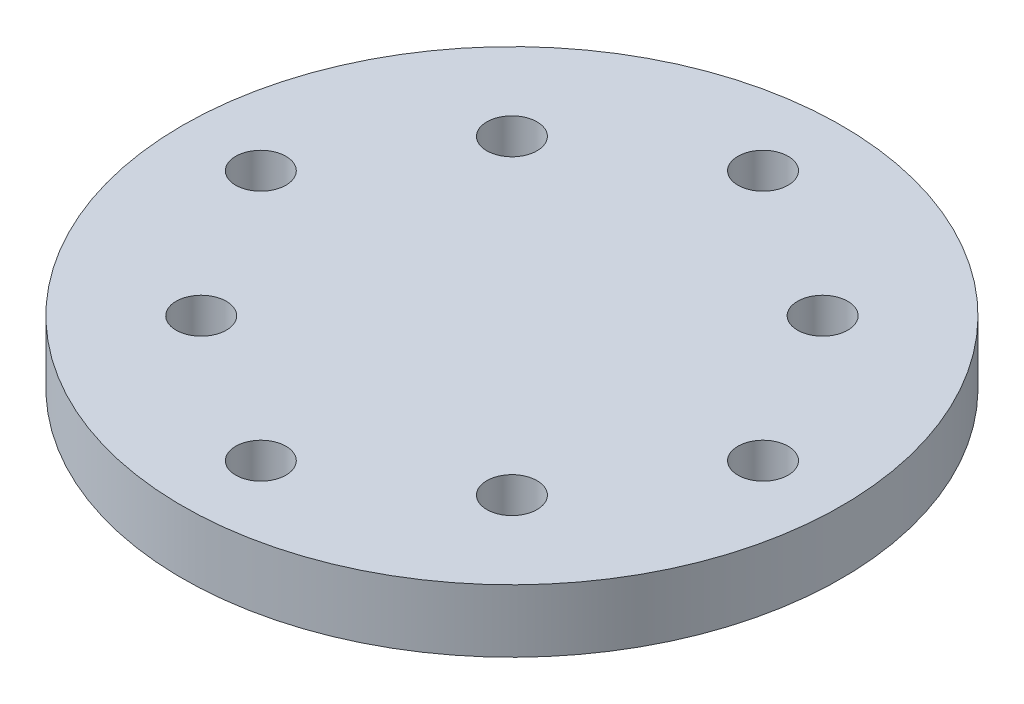
ISO-10303-21;
HEADER;
FILE_DESCRIPTION(('STEP AP214'),'2;1');
FILE_NAME('part.step','',(''),(''),'','','');
FILE_SCHEMA(('AUTOMOTIVE_DESIGN { 1 0 10303 214 1 1 1 1 }'));
ENDSEC;
DATA;
#1=APPLICATION_CONTEXT('core data for automotive mechanical design processes');
#2=APPLICATION_PROTOCOL_DEFINITION('international standard','automotive_design',2000,#1);
#3=PRODUCT_CONTEXT('',#1,'mechanical');
#4=PRODUCT('Part','Part','',(#3));
#5=PRODUCT_RELATED_PRODUCT_CATEGORY('part','',(#4));
#6=PRODUCT_DEFINITION_FORMATION('','',#4);
#7=PRODUCT_DEFINITION_CONTEXT('part definition',#1,'design');
#8=PRODUCT_DEFINITION('design','',#6,#7);
#9=PRODUCT_DEFINITION_SHAPE('','',#8);
#10=(LENGTH_UNIT() NAMED_UNIT(*) SI_UNIT(.MILLI.,.METRE.));
#11=(NAMED_UNIT(*) PLANE_ANGLE_UNIT() SI_UNIT($,.RADIAN.));
#12=(NAMED_UNIT(*) SI_UNIT($,.STERADIAN.) SOLID_ANGLE_UNIT());
#13=UNCERTAINTY_MEASURE_WITH_UNIT(LENGTH_MEASURE(1.E-05),#10,'distance_accuracy_value','');
#14=(GEOMETRIC_REPRESENTATION_CONTEXT(3) GLOBAL_UNCERTAINTY_ASSIGNED_CONTEXT((#13)) GLOBAL_UNIT_ASSIGNED_CONTEXT((#10,
#11,#12)) REPRESENTATION_CONTEXT('',''));
#15=CARTESIAN_POINT('',(0.,0.,0.));
#16=DIRECTION('',(0.,0.,1.));
#17=DIRECTION('',(1.,0.,0.));
#18=AXIS2_PLACEMENT_3D('',#15,#16,#17);
#19=CARTESIAN_POINT('',(0.,0.,0.));
#20=DIRECTION('',(0.,-1.,0.));
#21=DIRECTION('',(1.,0.,0.));
#22=AXIS2_PLACEMENT_3D('',#19,#20,#21);
#23=PLANE('',#22);
#24=CARTESIAN_POINT('',(0.,0.,0.));
#25=DIRECTION('',(0.,1.,0.));
#26=DIRECTION('',(-1.,0.,0.));
#27=AXIS2_PLACEMENT_3D('',#24,#25,#26);
#28=CIRCLE('',#27,5.);
#29=CARTESIAN_POINT('',(-5.,0.,0.));
#30=VERTEX_POINT('',#29);
#31=EDGE_CURVE('E10',#30,#30,#28,.T.);
#32=ORIENTED_EDGE('',*,*,#31,.F.);
#33=EDGE_LOOP('',(#32));
#34=FACE_BOUND('',#33,.T.);
#35=ADVANCED_FACE('F32',(#34),#23,.T.);
#36=CARTESIAN_POINT('',(0.,5.,0.));
#37=DIRECTION('',(0.,1.,0.));
#38=DIRECTION('',(-1.,0.,0.));
#39=AXIS2_PLACEMENT_3D('',#36,#37,#38);
#40=CYLINDRICAL_SURFACE('',#39,5.);
#41=ORIENTED_EDGE('',*,*,#31,.T.);
#42=EDGE_LOOP('',(#41));
#43=FACE_BOUND('',#42,.T.);
#44=CARTESIAN_POINT('',(0.,3.,0.));
#45=DIRECTION('',(0.,1.,0.));
#46=DIRECTION('',(-1.,0.,0.));
#47=AXIS2_PLACEMENT_3D('',#44,#45,#46);
#48=CIRCLE('',#47,5.);
#49=CARTESIAN_POINT('',(-5.,3.,0.));
#50=VERTEX_POINT('',#49);
#51=EDGE_CURVE('E38',#50,#50,#48,.T.);
#52=ORIENTED_EDGE('',*,*,#51,.F.);
#53=EDGE_LOOP('',(#52));
#54=FACE_BOUND('',#53,.T.);
#55=ADVANCED_FACE('F131',(#43,#54),#40,.T.);
#56=CARTESIAN_POINT('',(-5.,3.,0.));
#57=DIRECTION('',(0.,-1.,0.));
#58=DIRECTION('',(1.,0.,0.));
#59=AXIS2_PLACEMENT_3D('',#56,#57,#58);
#60=PLANE('',#59);
#61=CARTESIAN_POINT('',(0.,3.,8.));
#62=DIRECTION('',(0.,-1.,0.));
#63=DIRECTION('',(1.,0.,0.));
#64=AXIS2_PLACEMENT_3D('',#61,#62,#63);
#65=CIRCLE('',#64,0.799999999999998);
#66=CARTESIAN_POINT('',(0.800000000000082,3.,8.));
#67=VERTEX_POINT('',#66);
#68=EDGE_CURVE('E93',#67,#67,#65,.T.);
#69=ORIENTED_EDGE('',*,*,#68,.F.);
#70=EDGE_LOOP('',(#69));
#71=FACE_BOUND('',#70,.T.);
#72=CARTESIAN_POINT('',(-4.94974746830578,3.,4.94974746830589));
#73=DIRECTION('',(0.,-1.,0.));
#74=DIRECTION('',(1.,0.,0.));
#75=AXIS2_PLACEMENT_3D('',#72,#73,#74);
#76=CIRCLE('',#75,0.799999999999998);
#77=CARTESIAN_POINT('',(-4.14974746830578,3.,4.94974746830589));
#78=VERTEX_POINT('',#77);
#79=EDGE_CURVE('E87',#78,#78,#76,.T.);
#80=ORIENTED_EDGE('',*,*,#79,.F.);
#81=EDGE_LOOP('',(#80));
#82=FACE_BOUND('',#81,.T.);
#83=CARTESIAN_POINT('',(-8.,3.,0.));
#84=DIRECTION('',(0.,-1.,0.));
#85=DIRECTION('',(1.,0.,0.));
#86=AXIS2_PLACEMENT_3D('',#83,#84,#85);
#87=CIRCLE('',#86,0.799999999999999);
#88=CARTESIAN_POINT('',(-7.2,3.,0.));
#89=VERTEX_POINT('',#88);
#90=EDGE_CURVE('E81',#89,#89,#87,.T.);
#91=ORIENTED_EDGE('',*,*,#90,.F.);
#92=EDGE_LOOP('',(#91));
#93=FACE_BOUND('',#92,.T.);
#94=CARTESIAN_POINT('',(-4.94974746830583,3.,-4.94974746830583));
#95=DIRECTION('',(0.,-1.,0.));
#96=DIRECTION('',(1.,0.,0.));
#97=AXIS2_PLACEMENT_3D('',#94,#95,#96);
#98=CIRCLE('',#97,0.799999999999998);
#99=CARTESIAN_POINT('',(-4.14974746830584,3.,-4.94974746830583));
#100=VERTEX_POINT('',#99);
#101=EDGE_CURVE('E75',#100,#100,#98,.T.);
#102=ORIENTED_EDGE('',*,*,#101,.F.);
#103=EDGE_LOOP('',(#102));
#104=FACE_BOUND('',#103,.T.);
#105=CARTESIAN_POINT('',(0.,3.,-8.));
#106=DIRECTION('',(0.,-1.,0.));
#107=DIRECTION('',(1.,0.,0.));
#108=AXIS2_PLACEMENT_3D('',#105,#106,#107);
#109=CIRCLE('',#108,0.799999999999998);
#110=CARTESIAN_POINT('',(0.79999999999997,3.,-8.));
#111=VERTEX_POINT('',#110);
#112=EDGE_CURVE('E69',#111,#111,#109,.T.);
#113=ORIENTED_EDGE('',*,*,#112,.F.);
#114=EDGE_LOOP('',(#113));
#115=FACE_BOUND('',#114,.T.);
#116=CARTESIAN_POINT('',(4.94974746830581,3.,-4.94974746830585));
#117=DIRECTION('',(0.,-1.,0.));
#118=DIRECTION('',(1.,0.,0.));
#119=AXIS2_PLACEMENT_3D('',#116,#117,#118);
#120=CIRCLE('',#119,0.799999999999998);
#121=CARTESIAN_POINT('',(5.74974746830581,3.,-4.94974746830585));
#122=VERTEX_POINT('',#121);
#123=EDGE_CURVE('E63',#122,#122,#120,.T.);
#124=ORIENTED_EDGE('',*,*,#123,.F.);
#125=EDGE_LOOP('',(#124));
#126=FACE_BOUND('',#125,.T.);
#127=CARTESIAN_POINT('',(8.,3.,0.));
#128=DIRECTION('',(0.,-1.,0.));
#129=DIRECTION('',(1.,0.,0.));
#130=AXIS2_PLACEMENT_3D('',#127,#128,#129);
#131=CIRCLE('',#130,0.799999999999999);
#132=CARTESIAN_POINT('',(8.8,3.,0.));
#133=VERTEX_POINT('',#132);
#134=EDGE_CURVE('E57',#133,#133,#131,.T.);
#135=ORIENTED_EDGE('',*,*,#134,.F.);
#136=EDGE_LOOP('',(#135));
#137=FACE_BOUND('',#136,.T.);
#138=CARTESIAN_POINT('',(4.94974746830583,3.,4.94974746830583));
#139=DIRECTION('',(0.,-1.,0.));
#140=DIRECTION('',(1.,0.,0.));
#141=AXIS2_PLACEMENT_3D('',#138,#139,#140);
#142=CIRCLE('',#141,0.799999999999999);
#143=CARTESIAN_POINT('',(5.74974746830583,3.,4.94974746830583));
#144=VERTEX_POINT('',#143);
#145=EDGE_CURVE('E51',#144,#144,#142,.T.);
#146=ORIENTED_EDGE('',*,*,#145,.F.);
#147=EDGE_LOOP('',(#146));
#148=FACE_BOUND('',#147,.T.);
#149=ORIENTED_EDGE('',*,*,#51,.T.);
#150=EDGE_LOOP('',(#149));
#151=FACE_BOUND('',#150,.T.);
#152=CARTESIAN_POINT('',(0.,3.,0.));
#153=DIRECTION('',(0.,1.,0.));
#154=DIRECTION('',(-1.,0.,0.));
#155=AXIS2_PLACEMENT_3D('',#152,#153,#154);
#156=CIRCLE('',#155,10.5);
#157=CARTESIAN_POINT('',(-10.5,3.,0.));
#158=VERTEX_POINT('',#157);
#159=EDGE_CURVE('E42',#158,#158,#156,.T.);
#160=ORIENTED_EDGE('',*,*,#159,.F.);
#161=EDGE_LOOP('',(#160));
#162=FACE_BOUND('',#161,.T.);
#163=ADVANCED_FACE('F125',(#71,#82,#93,#104,#115,#126,#137,#148,#151,#162),#60,.T.);
#164=CARTESIAN_POINT('',(0.,5.,0.));
#165=DIRECTION('',(0.,1.,0.));
#166=DIRECTION('',(-1.,0.,0.));
#167=AXIS2_PLACEMENT_3D('',#164,#165,#166);
#168=CYLINDRICAL_SURFACE('',#167,10.5);
#169=ORIENTED_EDGE('',*,*,#159,.T.);
#170=EDGE_LOOP('',(#169));
#171=FACE_BOUND('',#170,.T.);
#172=CARTESIAN_POINT('',(0.,5.,0.));
#173=DIRECTION('',(0.,1.,0.));
#174=DIRECTION('',(-1.,0.,0.));
#175=AXIS2_PLACEMENT_3D('',#172,#173,#174);
#176=CIRCLE('',#175,10.5);
#177=CARTESIAN_POINT('',(-10.5,5.,0.));
#178=VERTEX_POINT('',#177);
#179=EDGE_CURVE('E46',#178,#178,#176,.T.);
#180=ORIENTED_EDGE('',*,*,#179,.F.);
#181=EDGE_LOOP('',(#180));
#182=FACE_BOUND('',#181,.T.);
#183=ADVANCED_FACE('F106',(#171,#182),#168,.T.);
#184=CARTESIAN_POINT('',(-10.5,5.,0.));
#185=DIRECTION('',(0.,1.,0.));
#186=DIRECTION('',(-1.,0.,0.));
#187=AXIS2_PLACEMENT_3D('',#184,#185,#186);
#188=PLANE('',#187);
#189=CARTESIAN_POINT('',(0.,5.,8.));
#190=DIRECTION('',(0.,1.,0.));
#191=DIRECTION('',(0.,0.,1.));
#192=AXIS2_PLACEMENT_3D('',#189,#190,#191);
#193=CIRCLE('',#192,0.799999999999999);
#194=CARTESIAN_POINT('',(0.,5.,8.8));
#195=VERTEX_POINT('',#194);
#196=EDGE_CURVE('E96',#195,#195,#193,.T.);
#197=ORIENTED_EDGE('',*,*,#196,.F.);
#198=EDGE_LOOP('',(#197));
#199=FACE_BOUND('',#198,.T.);
#200=CARTESIAN_POINT('',(-4.94974746830578,5.,4.94974746830589));
#201=DIRECTION('',(0.,1.,0.));
#202=DIRECTION('',(0.,0.,1.));
#203=AXIS2_PLACEMENT_3D('',#200,#201,#202);
#204=CIRCLE('',#203,0.799999999999999);
#205=CARTESIAN_POINT('',(-4.94974746830578,5.,5.74974746830588));
#206=VERTEX_POINT('',#205);
#207=EDGE_CURVE('E90',#206,#206,#204,.T.);
#208=ORIENTED_EDGE('',*,*,#207,.F.);
#209=EDGE_LOOP('',(#208));
#210=FACE_BOUND('',#209,.T.);
#211=CARTESIAN_POINT('',(-8.,5.,0.));
#212=DIRECTION('',(0.,1.,0.));
#213=DIRECTION('',(0.,0.,1.));
#214=AXIS2_PLACEMENT_3D('',#211,#212,#213);
#215=CIRCLE('',#214,0.799999999999999);
#216=CARTESIAN_POINT('',(-8.,5.,0.799999999999999));
#217=VERTEX_POINT('',#216);
#218=EDGE_CURVE('E84',#217,#217,#215,.T.);
#219=ORIENTED_EDGE('',*,*,#218,.F.);
#220=EDGE_LOOP('',(#219));
#221=FACE_BOUND('',#220,.T.);
#222=CARTESIAN_POINT('',(-4.94974746830583,5.,-4.94974746830583));
#223=DIRECTION('',(0.,1.,0.));
#224=DIRECTION('',(0.,0.,1.));
#225=AXIS2_PLACEMENT_3D('',#222,#223,#224);
#226=CIRCLE('',#225,0.799999999999999);
#227=CARTESIAN_POINT('',(-4.94974746830583,5.,-4.14974746830583));
#228=VERTEX_POINT('',#227);
#229=EDGE_CURVE('E78',#228,#228,#226,.T.);
#230=ORIENTED_EDGE('',*,*,#229,.F.);
#231=EDGE_LOOP('',(#230));
#232=FACE_BOUND('',#231,.T.);
#233=CARTESIAN_POINT('',(0.,5.,-8.));
#234=DIRECTION('',(0.,1.,0.));
#235=DIRECTION('',(0.,0.,1.));
#236=AXIS2_PLACEMENT_3D('',#233,#234,#235);
#237=CIRCLE('',#236,0.799999999999999);
#238=CARTESIAN_POINT('',(0.,5.,-7.2));
#239=VERTEX_POINT('',#238);
#240=EDGE_CURVE('E72',#239,#239,#237,.T.);
#241=ORIENTED_EDGE('',*,*,#240,.F.);
#242=EDGE_LOOP('',(#241));
#243=FACE_BOUND('',#242,.T.);
#244=CARTESIAN_POINT('',(4.94974746830581,5.,-4.94974746830585));
#245=DIRECTION('',(0.,1.,0.));
#246=DIRECTION('',(0.,0.,1.));
#247=AXIS2_PLACEMENT_3D('',#244,#245,#246);
#248=CIRCLE('',#247,0.799999999999999);
#249=CARTESIAN_POINT('',(4.94974746830581,5.,-4.14974746830585));
#250=VERTEX_POINT('',#249);
#251=EDGE_CURVE('E66',#250,#250,#248,.T.);
#252=ORIENTED_EDGE('',*,*,#251,.F.);
#253=EDGE_LOOP('',(#252));
#254=FACE_BOUND('',#253,.T.);
#255=CARTESIAN_POINT('',(8.,5.,0.));
#256=DIRECTION('',(0.,1.,0.));
#257=DIRECTION('',(0.,0.,1.));
#258=AXIS2_PLACEMENT_3D('',#255,#256,#257);
#259=CIRCLE('',#258,0.799999999999999);
#260=CARTESIAN_POINT('',(8.,5.,0.799999999999999));
#261=VERTEX_POINT('',#260);
#262=EDGE_CURVE('E60',#261,#261,#259,.T.);
#263=ORIENTED_EDGE('',*,*,#262,.F.);
#264=EDGE_LOOP('',(#263));
#265=FACE_BOUND('',#264,.T.);
#266=CARTESIAN_POINT('',(4.94974746830583,5.,4.94974746830583));
#267=DIRECTION('',(0.,1.,0.));
#268=DIRECTION('',(0.,0.,1.));
#269=AXIS2_PLACEMENT_3D('',#266,#267,#268);
#270=CIRCLE('',#269,0.799999999999999);
#271=CARTESIAN_POINT('',(4.94974746830583,5.,5.74974746830583));
#272=VERTEX_POINT('',#271);
#273=EDGE_CURVE('E54',#272,#272,#270,.T.);
#274=ORIENTED_EDGE('',*,*,#273,.F.);
#275=EDGE_LOOP('',(#274));
#276=FACE_BOUND('',#275,.T.);
#277=ORIENTED_EDGE('',*,*,#179,.T.);
#278=EDGE_LOOP('',(#277));
#279=FACE_BOUND('',#278,.T.);
#280=ADVANCED_FACE('F102',(#199,#210,#221,#232,#243,#254,#265,#276,#279),#188,.T.);
#281=CARTESIAN_POINT('',(4.94974746830583,5.,4.94974746830583));
#282=DIRECTION('',(0.,1.,0.));
#283=DIRECTION('',(0.,0.,1.));
#284=AXIS2_PLACEMENT_3D('',#281,#282,#283);
#285=CYLINDRICAL_SURFACE('',#284,0.799999999999999);
#286=ORIENTED_EDGE('',*,*,#145,.T.);
#287=EDGE_LOOP('',(#286));
#288=FACE_BOUND('',#287,.T.);
#289=ORIENTED_EDGE('',*,*,#273,.T.);
#290=EDGE_LOOP('',(#289));
#291=FACE_BOUND('',#290,.T.);
#292=ADVANCED_FACE('F105',(#288,#291),#285,.F.);
#293=CARTESIAN_POINT('',(8.,5.,0.));
#294=DIRECTION('',(0.,1.,0.));
#295=DIRECTION('',(0.,0.,1.));
#296=AXIS2_PLACEMENT_3D('',#293,#294,#295);
#297=CYLINDRICAL_SURFACE('',#296,0.799999999999999);
#298=ORIENTED_EDGE('',*,*,#134,.T.);
#299=EDGE_LOOP('',(#298));
#300=FACE_BOUND('',#299,.T.);
#301=ORIENTED_EDGE('',*,*,#262,.T.);
#302=EDGE_LOOP('',(#301));
#303=FACE_BOUND('',#302,.T.);
#304=ADVANCED_FACE('F153',(#300,#303),#297,.F.);
#305=CARTESIAN_POINT('',(4.94974746830581,5.,-4.94974746830585));
#306=DIRECTION('',(0.,1.,0.));
#307=DIRECTION('',(0.,0.,1.));
#308=AXIS2_PLACEMENT_3D('',#305,#306,#307);
#309=CYLINDRICAL_SURFACE('',#308,0.799999999999998);
#310=ORIENTED_EDGE('',*,*,#123,.T.);
#311=EDGE_LOOP('',(#310));
#312=FACE_BOUND('',#311,.T.);
#313=ORIENTED_EDGE('',*,*,#251,.T.);
#314=EDGE_LOOP('',(#313));
#315=FACE_BOUND('',#314,.T.);
#316=ADVANCED_FACE('F166',(#312,#315),#309,.F.);
#317=CARTESIAN_POINT('',(0.,5.,-8.));
#318=DIRECTION('',(0.,1.,0.));
#319=DIRECTION('',(0.,0.,1.));
#320=AXIS2_PLACEMENT_3D('',#317,#318,#319);
#321=CYLINDRICAL_SURFACE('',#320,0.799999999999998);
#322=ORIENTED_EDGE('',*,*,#112,.T.);
#323=EDGE_LOOP('',(#322));
#324=FACE_BOUND('',#323,.T.);
#325=ORIENTED_EDGE('',*,*,#240,.T.);
#326=EDGE_LOOP('',(#325));
#327=FACE_BOUND('',#326,.T.);
#328=ADVANCED_FACE('F172',(#324,#327),#321,.F.);
#329=CARTESIAN_POINT('',(-4.94974746830583,5.,-4.94974746830583));
#330=DIRECTION('',(0.,1.,0.));
#331=DIRECTION('',(0.,0.,1.));
#332=AXIS2_PLACEMENT_3D('',#329,#330,#331);
#333=CYLINDRICAL_SURFACE('',#332,0.799999999999998);
#334=ORIENTED_EDGE('',*,*,#101,.T.);
#335=EDGE_LOOP('',(#334));
#336=FACE_BOUND('',#335,.T.);
#337=ORIENTED_EDGE('',*,*,#229,.T.);
#338=EDGE_LOOP('',(#337));
#339=FACE_BOUND('',#338,.T.);
#340=ADVANCED_FACE('F185',(#336,#339),#333,.F.);
#341=CARTESIAN_POINT('',(-8.,5.,0.));
#342=DIRECTION('',(0.,1.,0.));
#343=DIRECTION('',(0.,0.,1.));
#344=AXIS2_PLACEMENT_3D('',#341,#342,#343);
#345=CYLINDRICAL_SURFACE('',#344,0.799999999999999);
#346=ORIENTED_EDGE('',*,*,#90,.T.);
#347=EDGE_LOOP('',(#346));
#348=FACE_BOUND('',#347,.T.);
#349=ORIENTED_EDGE('',*,*,#218,.T.);
#350=EDGE_LOOP('',(#349));
#351=FACE_BOUND('',#350,.T.);
#352=ADVANCED_FACE('F197',(#348,#351),#345,.F.);
#353=CARTESIAN_POINT('',(-4.94974746830578,5.,4.94974746830589));
#354=DIRECTION('',(0.,1.,0.));
#355=DIRECTION('',(0.,0.,1.));
#356=AXIS2_PLACEMENT_3D('',#353,#354,#355);
#357=CYLINDRICAL_SURFACE('',#356,0.799999999999998);
#358=ORIENTED_EDGE('',*,*,#79,.T.);
#359=EDGE_LOOP('',(#358));
#360=FACE_BOUND('',#359,.T.);
#361=ORIENTED_EDGE('',*,*,#207,.T.);
#362=EDGE_LOOP('',(#361));
#363=FACE_BOUND('',#362,.T.);
#364=ADVANCED_FACE('F207',(#360,#363),#357,.F.);
#365=CARTESIAN_POINT('',(0.,5.,8.));
#366=DIRECTION('',(0.,1.,0.));
#367=DIRECTION('',(0.,0.,1.));
#368=AXIS2_PLACEMENT_3D('',#365,#366,#367);
#369=CYLINDRICAL_SURFACE('',#368,0.799999999999998);
#370=ORIENTED_EDGE('',*,*,#68,.T.);
#371=EDGE_LOOP('',(#370));
#372=FACE_BOUND('',#371,.T.);
#373=ORIENTED_EDGE('',*,*,#196,.T.);
#374=EDGE_LOOP('',(#373));
#375=FACE_BOUND('',#374,.T.);
#376=ADVANCED_FACE('F100',(#372,#375),#369,.F.);
#377=CLOSED_SHELL('',(#35,#55,#163,#183,#280,#292,#304,#316,#328,#340,#352,#364,#376));
#378=MANIFOLD_SOLID_BREP('B2',#377);
#379=ADVANCED_BREP_SHAPE_REPRESENTATION('',(#18,#378),#14);
#380=SHAPE_DEFINITION_REPRESENTATION(#9,#379);
ENDSEC;
END-ISO-10303-21;
